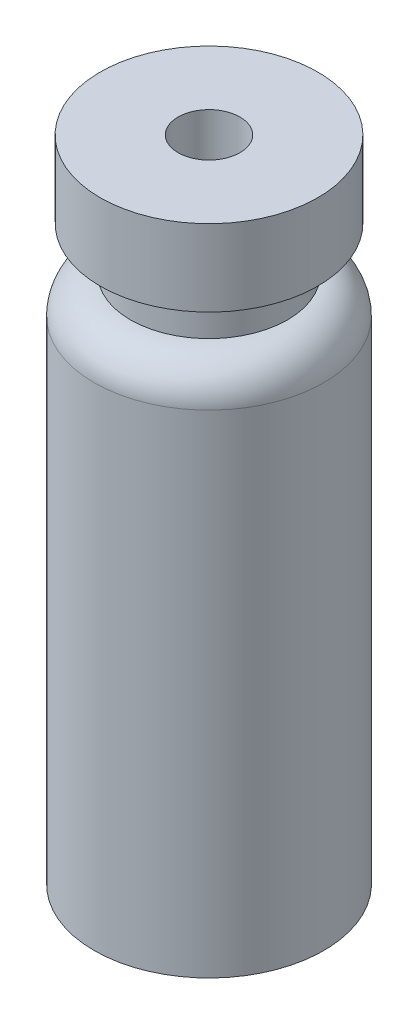
ISO-10303-21;
HEADER;
FILE_DESCRIPTION(('STEP AP214'),'2;1');
FILE_NAME('part.step','',(''),(''),'','','');
FILE_SCHEMA(('AUTOMOTIVE_DESIGN { 1 0 10303 214 1 1 1 1 }'));
ENDSEC;
DATA;
#1=APPLICATION_CONTEXT('core data for automotive mechanical design processes');
#2=APPLICATION_PROTOCOL_DEFINITION('international standard','automotive_design',2000,#1);
#3=PRODUCT_CONTEXT('',#1,'mechanical');
#4=PRODUCT('Part','Part','',(#3));
#5=PRODUCT_RELATED_PRODUCT_CATEGORY('part','',(#4));
#6=PRODUCT_DEFINITION_FORMATION('','',#4);
#7=PRODUCT_DEFINITION_CONTEXT('part definition',#1,'design');
#8=PRODUCT_DEFINITION('design','',#6,#7);
#9=PRODUCT_DEFINITION_SHAPE('','',#8);
#10=(LENGTH_UNIT() NAMED_UNIT(*) SI_UNIT(.MILLI.,.METRE.));
#11=(NAMED_UNIT(*) PLANE_ANGLE_UNIT() SI_UNIT($,.RADIAN.));
#12=(NAMED_UNIT(*) SI_UNIT($,.STERADIAN.) SOLID_ANGLE_UNIT());
#13=UNCERTAINTY_MEASURE_WITH_UNIT(LENGTH_MEASURE(1.E-05),#10,'distance_accuracy_value','');
#14=(GEOMETRIC_REPRESENTATION_CONTEXT(3) GLOBAL_UNCERTAINTY_ASSIGNED_CONTEXT((#13)) GLOBAL_UNIT_ASSIGNED_CONTEXT((#10,
#11,#12)) REPRESENTATION_CONTEXT('',''));
#15=CARTESIAN_POINT('',(0.,0.,0.));
#16=DIRECTION('',(0.,0.,1.));
#17=DIRECTION('',(1.,0.,0.));
#18=AXIS2_PLACEMENT_3D('',#15,#16,#17);
#19=CARTESIAN_POINT('',(0.,0.,0.));
#20=DIRECTION('',(0.,1.,0.));
#21=DIRECTION('',(0.,0.,1.));
#22=AXIS2_PLACEMENT_3D('',#19,#20,#21);
#23=PLANE('',#22);
#24=CARTESIAN_POINT('',(0.,0.,0.));
#25=DIRECTION('',(0.,1.,0.));
#26=DIRECTION('',(0.,0.,1.));
#27=AXIS2_PLACEMENT_3D('',#24,#25,#26);
#28=CIRCLE('',#27,5.7);
#29=CARTESIAN_POINT('',(0.,0.,5.7));
#30=VERTEX_POINT('',#29);
#31=EDGE_CURVE('E10',#30,#30,#28,.T.);
#32=ORIENTED_EDGE('',*,*,#31,.F.);
#33=EDGE_LOOP('',(#32));
#34=FACE_BOUND('',#33,.T.);
#35=ADVANCED_FACE('F31',(#34),#23,.F.);
#36=CARTESIAN_POINT('',(0.,32.2,0.));
#37=DIRECTION('',(0.,1.,0.));
#38=DIRECTION('',(0.,0.,1.));
#39=AXIS2_PLACEMENT_3D('',#36,#37,#38);
#40=CYLINDRICAL_SURFACE('',#39,5.7);
#41=CARTESIAN_POINT('',(0.,24.4,0.));
#42=DIRECTION('',(0.,1.,0.));
#43=DIRECTION('',(0.,0.,1.));
#44=AXIS2_PLACEMENT_3D('',#41,#42,#43);
#45=CIRCLE('',#44,5.7);
#46=CARTESIAN_POINT('',(0.,24.4,5.7));
#47=VERTEX_POINT('',#46);
#48=EDGE_CURVE('E37',#47,#47,#45,.T.);
#49=ORIENTED_EDGE('',*,*,#48,.F.);
#50=EDGE_LOOP('',(#49));
#51=FACE_BOUND('',#50,.T.);
#52=ORIENTED_EDGE('',*,*,#31,.T.);
#53=EDGE_LOOP('',(#52));
#54=FACE_BOUND('',#53,.T.);
#55=ADVANCED_FACE('F106',(#51,#54),#40,.T.);
#56=CARTESIAN_POINT('',(0.,24.4,0.));
#57=DIRECTION('',(0.,1.,0.));
#58=DIRECTION('',(0.,0.,1.));
#59=AXIS2_PLACEMENT_3D('',#56,#57,#58);
#60=TOROIDAL_SURFACE('',#59,3.9,1.8);
#61=CARTESIAN_POINT('',(0.,26.2,0.));
#62=DIRECTION('',(0.,1.,0.));
#63=DIRECTION('',(0.,0.,1.));
#64=AXIS2_PLACEMENT_3D('',#61,#62,#63);
#65=CIRCLE('',#64,3.9);
#66=CARTESIAN_POINT('',(0.,26.2,3.9));
#67=VERTEX_POINT('',#66);
#68=EDGE_CURVE('E41',#67,#67,#65,.T.);
#69=ORIENTED_EDGE('',*,*,#68,.F.);
#70=EDGE_LOOP('',(#69));
#71=FACE_BOUND('',#70,.T.);
#72=ORIENTED_EDGE('',*,*,#48,.T.);
#73=EDGE_LOOP('',(#72));
#74=FACE_BOUND('',#73,.T.);
#75=ADVANCED_FACE('F101',(#71,#74),#60,.T.);
#76=CARTESIAN_POINT('',(0.,32.2,0.));
#77=DIRECTION('',(0.,1.,0.));
#78=DIRECTION('',(0.,0.,1.));
#79=AXIS2_PLACEMENT_3D('',#76,#77,#78);
#80=CYLINDRICAL_SURFACE('',#79,3.9);
#81=CARTESIAN_POINT('',(0.,28.4,0.));
#82=DIRECTION('',(0.,1.,0.));
#83=DIRECTION('',(0.,0.,1.));
#84=AXIS2_PLACEMENT_3D('',#81,#82,#83);
#85=CIRCLE('',#84,3.9);
#86=CARTESIAN_POINT('',(0.,28.4,3.9));
#87=VERTEX_POINT('',#86);
#88=EDGE_CURVE('E45',#87,#87,#85,.T.);
#89=ORIENTED_EDGE('',*,*,#88,.F.);
#90=EDGE_LOOP('',(#89));
#91=FACE_BOUND('',#90,.T.);
#92=ORIENTED_EDGE('',*,*,#68,.T.);
#93=EDGE_LOOP('',(#92));
#94=FACE_BOUND('',#93,.T.);
#95=ADVANCED_FACE('F95',(#91,#94),#80,.T.);
#96=CARTESIAN_POINT('',(3.9,28.4,0.));
#97=DIRECTION('',(0.,1.,0.));
#98=DIRECTION('',(0.,0.,1.));
#99=AXIS2_PLACEMENT_3D('',#96,#97,#98);
#100=PLANE('',#99);
#101=CARTESIAN_POINT('',(0.,28.4,0.));
#102=DIRECTION('',(0.,1.,0.));
#103=DIRECTION('',(0.,0.,1.));
#104=AXIS2_PLACEMENT_3D('',#101,#102,#103);
#105=CIRCLE('',#104,5.4);
#106=CARTESIAN_POINT('',(0.,28.4,5.4));
#107=VERTEX_POINT('',#106);
#108=EDGE_CURVE('E50',#107,#107,#105,.T.);
#109=ORIENTED_EDGE('',*,*,#108,.F.);
#110=EDGE_LOOP('',(#109));
#111=FACE_BOUND('',#110,.T.);
#112=ORIENTED_EDGE('',*,*,#88,.T.);
#113=EDGE_LOOP('',(#112));
#114=FACE_BOUND('',#113,.T.);
#115=ADVANCED_FACE('F89',(#111,#114),#100,.F.);
#116=CARTESIAN_POINT('',(0.,32.2,0.));
#117=DIRECTION('',(0.,1.,0.));
#118=DIRECTION('',(0.,0.,1.));
#119=AXIS2_PLACEMENT_3D('',#116,#117,#118);
#120=CYLINDRICAL_SURFACE('',#119,5.4);
#121=CARTESIAN_POINT('',(0.,32.2,0.));
#122=DIRECTION('',(0.,1.,0.));
#123=DIRECTION('',(0.,0.,1.));
#124=AXIS2_PLACEMENT_3D('',#121,#122,#123);
#125=CIRCLE('',#124,5.4);
#126=CARTESIAN_POINT('',(0.,32.2,5.4));
#127=VERTEX_POINT('',#126);
#128=EDGE_CURVE('E53',#127,#127,#125,.T.);
#129=ORIENTED_EDGE('',*,*,#128,.F.);
#130=EDGE_LOOP('',(#129));
#131=FACE_BOUND('',#130,.T.);
#132=ORIENTED_EDGE('',*,*,#108,.T.);
#133=EDGE_LOOP('',(#132));
#134=FACE_BOUND('',#133,.T.);
#135=ADVANCED_FACE('F83',(#131,#134),#120,.T.);
#136=CARTESIAN_POINT('',(5.4,32.2,0.));
#137=DIRECTION('',(0.,-1.,0.));
#138=DIRECTION('',(0.,0.,-1.));
#139=AXIS2_PLACEMENT_3D('',#136,#137,#138);
#140=PLANE('',#139);
#141=CARTESIAN_POINT('',(0.,32.2,0.));
#142=DIRECTION('',(0.,1.,0.));
#143=DIRECTION('',(0.,0.,1.));
#144=AXIS2_PLACEMENT_3D('',#141,#142,#143);
#145=CIRCLE('',#144,1.535);
#146=CARTESIAN_POINT('',(0.,32.2,1.535));
#147=VERTEX_POINT('',#146);
#148=EDGE_CURVE('E56',#147,#147,#145,.T.);
#149=ORIENTED_EDGE('',*,*,#148,.F.);
#150=EDGE_LOOP('',(#149));
#151=FACE_BOUND('',#150,.T.);
#152=ORIENTED_EDGE('',*,*,#128,.T.);
#153=EDGE_LOOP('',(#152));
#154=FACE_BOUND('',#153,.T.);
#155=ADVANCED_FACE('F77',(#151,#154),#140,.F.);
#156=CARTESIAN_POINT('',(0.,32.2,0.));
#157=DIRECTION('',(0.,1.,0.));
#158=DIRECTION('',(0.,0.,1.));
#159=AXIS2_PLACEMENT_3D('',#156,#157,#158);
#160=CYLINDRICAL_SURFACE('',#159,1.535);
#161=CARTESIAN_POINT('',(0.,9.83415456422022,0.));
#162=DIRECTION('',(0.,1.,0.));
#163=DIRECTION('',(0.,0.,1.));
#164=AXIS2_PLACEMENT_3D('',#161,#162,#163);
#165=CIRCLE('',#164,1.535);
#166=CARTESIAN_POINT('',(0.,9.83415456422022,1.535));
#167=VERTEX_POINT('',#166);
#168=EDGE_CURVE('E59',#167,#167,#165,.T.);
#169=ORIENTED_EDGE('',*,*,#168,.F.);
#170=EDGE_LOOP('',(#169));
#171=FACE_BOUND('',#170,.T.);
#172=ORIENTED_EDGE('',*,*,#148,.T.);
#173=EDGE_LOOP('',(#172));
#174=FACE_BOUND('',#173,.T.);
#175=ADVANCED_FACE('F71',(#171,#174),#160,.F.);
#176=CARTESIAN_POINT('',(0.,9.83415456422022,0.));
#177=DIRECTION('',(0.,1.,0.));
#178=DIRECTION('',(0.,0.,1.));
#179=AXIS2_PLACEMENT_3D('',#176,#177,#178);
#180=CONICAL_SURFACE('',#179,1.535,0.160961478938631);
#181=CARTESIAN_POINT('',(0.,3.4198663344658,0.));
#182=DIRECTION('',(0.,1.,0.));
#183=DIRECTION('',(0.,0.,1.));
#184=AXIS2_PLACEMENT_3D('',#181,#182,#183);
#185=CIRCLE('',#184,0.493536822991006);
#186=CARTESIAN_POINT('',(0.,3.4198663344658,0.493536822991006));
#187=VERTEX_POINT('',#186);
#188=EDGE_CURVE('E62',#187,#187,#185,.T.);
#189=ORIENTED_EDGE('',*,*,#188,.F.);
#190=EDGE_LOOP('',(#189));
#191=FACE_BOUND('',#190,.T.);
#192=ORIENTED_EDGE('',*,*,#168,.T.);
#193=EDGE_LOOP('',(#192));
#194=FACE_BOUND('',#193,.T.);
#195=ADVANCED_FACE('F68',(#191,#194),#180,.F.);
#196=CARTESIAN_POINT('',(0.,3.5,0.));
#197=DIRECTION('',(0.,1.,0.));
#198=DIRECTION('',(1.,0.,0.));
#199=AXIS2_PLACEMENT_3D('',#196,#197,#198);
#200=SPHERICAL_SURFACE('',#199,0.5);
#201=ORIENTED_EDGE('',*,*,#188,.T.);
#202=EDGE_LOOP('',(#201));
#203=FACE_BOUND('',#202,.T.);
#204=ADVANCED_FACE('F66',(#203),#200,.F.);
#205=CLOSED_SHELL('',(#35,#55,#75,#95,#115,#135,#155,#175,#195,#204));
#206=MANIFOLD_SOLID_BREP('B2',#205);
#207=ADVANCED_BREP_SHAPE_REPRESENTATION('',(#18,#206),#14);
#208=SHAPE_DEFINITION_REPRESENTATION(#9,#207);
ENDSEC;
END-ISO-10303-21;
